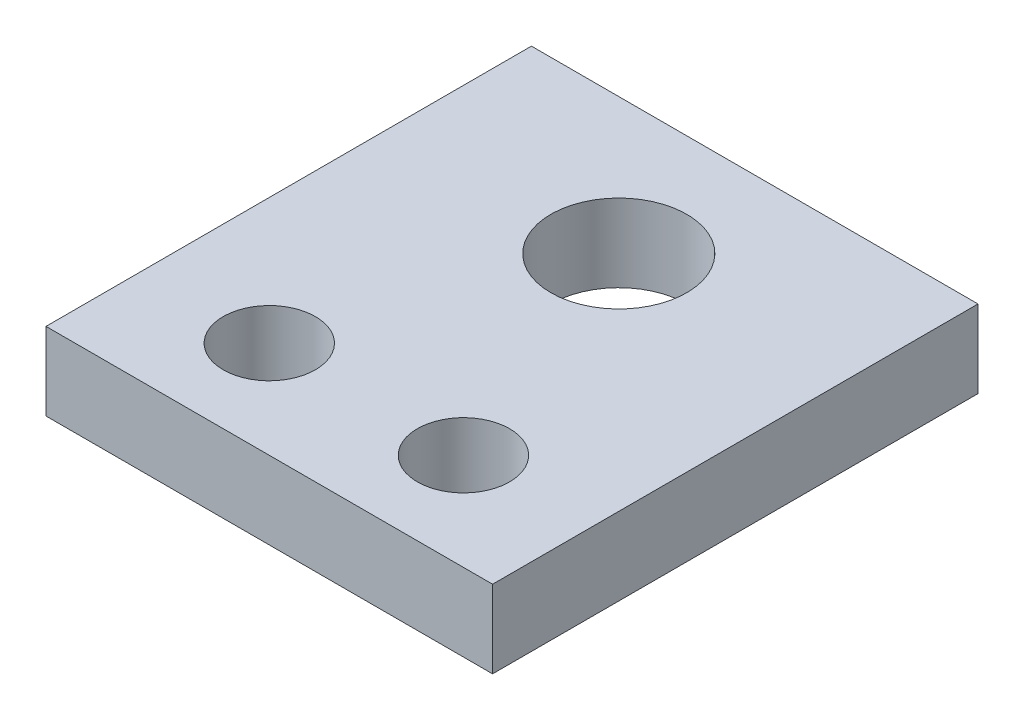
ISO-10303-21;
HEADER;
FILE_DESCRIPTION(('STEP AP214'),'2;1');
FILE_NAME('part.step','',(''),(''),'','','');
FILE_SCHEMA(('AUTOMOTIVE_DESIGN { 1 0 10303 214 1 1 1 1 }'));
ENDSEC;
DATA;
#1=APPLICATION_CONTEXT('core data for automotive mechanical design processes');
#2=APPLICATION_PROTOCOL_DEFINITION('international standard','automotive_design',2000,#1);
#3=PRODUCT_CONTEXT('',#1,'mechanical');
#4=PRODUCT('Part','Part','',(#3));
#5=PRODUCT_RELATED_PRODUCT_CATEGORY('part','',(#4));
#6=PRODUCT_DEFINITION_FORMATION('','',#4);
#7=PRODUCT_DEFINITION_CONTEXT('part definition',#1,'design');
#8=PRODUCT_DEFINITION('design','',#6,#7);
#9=PRODUCT_DEFINITION_SHAPE('','',#8);
#10=(LENGTH_UNIT() NAMED_UNIT(*) SI_UNIT(.MILLI.,.METRE.));
#11=(NAMED_UNIT(*) PLANE_ANGLE_UNIT() SI_UNIT($,.RADIAN.));
#12=(NAMED_UNIT(*) SI_UNIT($,.STERADIAN.) SOLID_ANGLE_UNIT());
#13=UNCERTAINTY_MEASURE_WITH_UNIT(LENGTH_MEASURE(1.E-05),#10,'distance_accuracy_value','');
#14=(GEOMETRIC_REPRESENTATION_CONTEXT(3) GLOBAL_UNCERTAINTY_ASSIGNED_CONTEXT((#13)) GLOBAL_UNIT_ASSIGNED_CONTEXT((#10,
#11,#12)) REPRESENTATION_CONTEXT('',''));
#15=CARTESIAN_POINT('',(0.,0.,0.));
#16=DIRECTION('',(0.,0.,1.));
#17=DIRECTION('',(1.,0.,0.));
#18=AXIS2_PLACEMENT_3D('',#15,#16,#17);
#19=CARTESIAN_POINT('',(23.,8.,-25.));
#20=DIRECTION('',(-1.,0.,0.));
#21=DIRECTION('',(0.,0.,1.));
#22=AXIS2_PLACEMENT_3D('',#19,#20,#21);
#23=PLANE('',#22);
#24=DIRECTION('',(0.,0.,-1.));
#25=VECTOR('',#24,1.);
#26=CARTESIAN_POINT('',(23.,0.,-25.));
#27=LINE('',#26,#25);
#28=CARTESIAN_POINT('',(23.,0.,25.));
#29=VERTEX_POINT('',#28);
#30=CARTESIAN_POINT('',(23.,0.,-25.));
#31=VERTEX_POINT('',#30);
#32=EDGE_CURVE('E100',#29,#31,#27,.T.);
#33=ORIENTED_EDGE('',*,*,#32,.T.);
#34=DIRECTION('',(0.,-1.,0.));
#35=VECTOR('',#34,1.);
#36=CARTESIAN_POINT('',(23.,8.,-25.));
#37=LINE('',#36,#35);
#38=CARTESIAN_POINT('',(23.,8.,-25.));
#39=VERTEX_POINT('',#38);
#40=EDGE_CURVE('E11',#39,#31,#37,.T.);
#41=ORIENTED_EDGE('',*,*,#40,.F.);
#42=DIRECTION('',(0.,0.,-1.));
#43=VECTOR('',#42,1.);
#44=CARTESIAN_POINT('',(23.,8.,-25.));
#45=LINE('',#44,#43);
#46=CARTESIAN_POINT('',(23.,8.,25.));
#47=VERTEX_POINT('',#46);
#48=EDGE_CURVE('E88',#47,#39,#45,.T.);
#49=ORIENTED_EDGE('',*,*,#48,.F.);
#50=DIRECTION('',(0.,-1.,0.));
#51=VECTOR('',#50,1.);
#52=CARTESIAN_POINT('',(23.,8.,25.));
#53=LINE('',#52,#51);
#54=EDGE_CURVE('E96',#47,#29,#53,.T.);
#55=ORIENTED_EDGE('',*,*,#54,.T.);
#56=EDGE_LOOP('',(#33,#41,#49,#55));
#57=FACE_BOUND('',#56,.T.);
#58=ADVANCED_FACE('F37',(#57),#23,.F.);
#59=CARTESIAN_POINT('',(-23.,8.,-25.));
#60=DIRECTION('',(0.,0.,1.));
#61=DIRECTION('',(1.,0.,0.));
#62=AXIS2_PLACEMENT_3D('',#59,#60,#61);
#63=PLANE('',#62);
#64=DIRECTION('',(-1.,0.,0.));
#65=VECTOR('',#64,1.);
#66=CARTESIAN_POINT('',(-23.,0.,-25.));
#67=LINE('',#66,#65);
#68=CARTESIAN_POINT('',(-23.,0.,-25.));
#69=VERTEX_POINT('',#68);
#70=EDGE_CURVE('E92',#31,#69,#67,.T.);
#71=ORIENTED_EDGE('',*,*,#70,.T.);
#72=DIRECTION('',(0.,-1.,0.));
#73=VECTOR('',#72,1.);
#74=CARTESIAN_POINT('',(-23.,8.,-25.));
#75=LINE('',#74,#73);
#76=CARTESIAN_POINT('',(-23.,8.,-25.));
#77=VERTEX_POINT('',#76);
#78=EDGE_CURVE('E45',#77,#69,#75,.T.);
#79=ORIENTED_EDGE('',*,*,#78,.F.);
#80=DIRECTION('',(-1.,0.,0.));
#81=VECTOR('',#80,1.);
#82=CARTESIAN_POINT('',(-23.,8.,-25.));
#83=LINE('',#82,#81);
#84=EDGE_CURVE('E83',#39,#77,#83,.T.);
#85=ORIENTED_EDGE('',*,*,#84,.F.);
#86=ORIENTED_EDGE('',*,*,#40,.T.);
#87=EDGE_LOOP('',(#71,#79,#85,#86));
#88=FACE_BOUND('',#87,.T.);
#89=ADVANCED_FACE('F91',(#88),#63,.F.);
#90=CARTESIAN_POINT('',(-23.,8.,-25.));
#91=DIRECTION('',(1.,0.,0.));
#92=DIRECTION('',(0.,0.,-1.));
#93=AXIS2_PLACEMENT_3D('',#90,#91,#92);
#94=PLANE('',#93);
#95=DIRECTION('',(0.,0.,1.));
#96=VECTOR('',#95,1.);
#97=CARTESIAN_POINT('',(-23.,0.,-25.));
#98=LINE('',#97,#96);
#99=CARTESIAN_POINT('',(-23.,0.,25.));
#100=VERTEX_POINT('',#99);
#101=EDGE_CURVE('E70',#69,#100,#98,.T.);
#102=ORIENTED_EDGE('',*,*,#101,.T.);
#103=DIRECTION('',(0.,-1.,0.));
#104=VECTOR('',#103,1.);
#105=CARTESIAN_POINT('',(-23.,8.,25.));
#106=LINE('',#105,#104);
#107=CARTESIAN_POINT('',(-23.,8.,25.));
#108=VERTEX_POINT('',#107);
#109=EDGE_CURVE('E93',#108,#100,#106,.T.);
#110=ORIENTED_EDGE('',*,*,#109,.F.);
#111=DIRECTION('',(0.,0.,1.));
#112=VECTOR('',#111,1.);
#113=CARTESIAN_POINT('',(-23.,8.,-25.));
#114=LINE('',#113,#112);
#115=EDGE_CURVE('E86',#77,#108,#114,.T.);
#116=ORIENTED_EDGE('',*,*,#115,.F.);
#117=ORIENTED_EDGE('',*,*,#78,.T.);
#118=EDGE_LOOP('',(#102,#110,#116,#117));
#119=FACE_BOUND('',#118,.T.);
#120=ADVANCED_FACE('F94',(#119),#94,.F.);
#121=CARTESIAN_POINT('',(-23.,8.,25.));
#122=DIRECTION('',(0.,0.,-1.));
#123=DIRECTION('',(-1.,0.,0.));
#124=AXIS2_PLACEMENT_3D('',#121,#122,#123);
#125=PLANE('',#124);
#126=DIRECTION('',(1.,0.,0.));
#127=VECTOR('',#126,1.);
#128=CARTESIAN_POINT('',(-23.,0.,25.));
#129=LINE('',#128,#127);
#130=EDGE_CURVE('E76',#100,#29,#129,.T.);
#131=ORIENTED_EDGE('',*,*,#130,.T.);
#132=ORIENTED_EDGE('',*,*,#54,.F.);
#133=DIRECTION('',(1.,0.,0.));
#134=VECTOR('',#133,1.);
#135=CARTESIAN_POINT('',(-23.,8.,25.));
#136=LINE('',#135,#134);
#137=EDGE_CURVE('E53',#108,#47,#136,.T.);
#138=ORIENTED_EDGE('',*,*,#137,.F.);
#139=ORIENTED_EDGE('',*,*,#109,.T.);
#140=EDGE_LOOP('',(#131,#132,#138,#139));
#141=FACE_BOUND('',#140,.T.);
#142=ADVANCED_FACE('F108',(#141),#125,.F.);
#143=CARTESIAN_POINT('',(0.,8.,0.));
#144=DIRECTION('',(0.,1.,0.));
#145=DIRECTION('',(0.,0.,1.));
#146=AXIS2_PLACEMENT_3D('',#143,#144,#145);
#147=PLANE('',#146);
#148=CARTESIAN_POINT('',(0.,8.,-11.));
#149=DIRECTION('',(0.,1.,0.));
#150=DIRECTION('',(0.,0.,1.));
#151=AXIS2_PLACEMENT_3D('',#148,#149,#150);
#152=CIRCLE('',#151,7.);
#153=CARTESIAN_POINT('',(0.,8.,-4.));
#154=VERTEX_POINT('',#153);
#155=EDGE_CURVE('E126',#154,#154,#152,.T.);
#156=ORIENTED_EDGE('',*,*,#155,.F.);
#157=EDGE_LOOP('',(#156));
#158=FACE_BOUND('',#157,.T.);
#159=CARTESIAN_POINT('',(-10.,8.,15.));
#160=DIRECTION('',(0.,1.,0.));
#161=DIRECTION('',(0.,0.,1.));
#162=AXIS2_PLACEMENT_3D('',#159,#160,#161);
#163=CIRCLE('',#162,4.75);
#164=CARTESIAN_POINT('',(-10.,8.,19.75));
#165=VERTEX_POINT('',#164);
#166=EDGE_CURVE('E120',#165,#165,#163,.T.);
#167=ORIENTED_EDGE('',*,*,#166,.F.);
#168=EDGE_LOOP('',(#167));
#169=FACE_BOUND('',#168,.T.);
#170=CARTESIAN_POINT('',(10.,8.,15.));
#171=DIRECTION('',(0.,1.,0.));
#172=DIRECTION('',(0.,0.,-1.));
#173=AXIS2_PLACEMENT_3D('',#170,#171,#172);
#174=CIRCLE('',#173,4.75);
#175=CARTESIAN_POINT('',(10.,8.,10.25));
#176=VERTEX_POINT('',#175);
#177=EDGE_CURVE('E114',#176,#176,#174,.T.);
#178=ORIENTED_EDGE('',*,*,#177,.F.);
#179=EDGE_LOOP('',(#178));
#180=FACE_BOUND('',#179,.T.);
#181=ORIENTED_EDGE('',*,*,#48,.T.);
#182=ORIENTED_EDGE('',*,*,#84,.T.);
#183=ORIENTED_EDGE('',*,*,#115,.T.);
#184=ORIENTED_EDGE('',*,*,#137,.T.);
#185=EDGE_LOOP('',(#181,#182,#183,#184));
#186=FACE_BOUND('',#185,.T.);
#187=ADVANCED_FACE('F84',(#158,#169,#180,#186),#147,.T.);
#188=CARTESIAN_POINT('',(0.,0.,0.));
#189=DIRECTION('',(0.,1.,0.));
#190=DIRECTION('',(0.,0.,1.));
#191=AXIS2_PLACEMENT_3D('',#188,#189,#190);
#192=PLANE('',#191);
#193=CARTESIAN_POINT('',(0.,0.,-11.));
#194=DIRECTION('',(0.,1.,0.));
#195=DIRECTION('',(0.,0.,1.));
#196=AXIS2_PLACEMENT_3D('',#193,#194,#195);
#197=CIRCLE('',#196,7.);
#198=CARTESIAN_POINT('',(0.,0.,-4.));
#199=VERTEX_POINT('',#198);
#200=EDGE_CURVE('E103',#199,#199,#197,.T.);
#201=ORIENTED_EDGE('',*,*,#200,.T.);
#202=EDGE_LOOP('',(#201));
#203=FACE_BOUND('',#202,.T.);
#204=CARTESIAN_POINT('',(-10.,0.,15.));
#205=DIRECTION('',(0.,1.,0.));
#206=DIRECTION('',(0.,0.,1.));
#207=AXIS2_PLACEMENT_3D('',#204,#205,#206);
#208=CIRCLE('',#207,4.75);
#209=CARTESIAN_POINT('',(-10.,0.,19.75));
#210=VERTEX_POINT('',#209);
#211=EDGE_CURVE('E123',#210,#210,#208,.T.);
#212=ORIENTED_EDGE('',*,*,#211,.T.);
#213=EDGE_LOOP('',(#212));
#214=FACE_BOUND('',#213,.T.);
#215=CARTESIAN_POINT('',(10.,0.,15.));
#216=DIRECTION('',(0.,1.,0.));
#217=DIRECTION('',(0.,0.,-1.));
#218=AXIS2_PLACEMENT_3D('',#215,#216,#217);
#219=CIRCLE('',#218,4.75);
#220=CARTESIAN_POINT('',(10.,0.,10.25));
#221=VERTEX_POINT('',#220);
#222=EDGE_CURVE('E117',#221,#221,#219,.T.);
#223=ORIENTED_EDGE('',*,*,#222,.T.);
#224=EDGE_LOOP('',(#223));
#225=FACE_BOUND('',#224,.T.);
#226=ORIENTED_EDGE('',*,*,#32,.F.);
#227=ORIENTED_EDGE('',*,*,#130,.F.);
#228=ORIENTED_EDGE('',*,*,#101,.F.);
#229=ORIENTED_EDGE('',*,*,#70,.F.);
#230=EDGE_LOOP('',(#226,#227,#228,#229));
#231=FACE_BOUND('',#230,.T.);
#232=ADVANCED_FACE('F111',(#203,#214,#225,#231),#192,.F.);
#233=CARTESIAN_POINT('',(10.,0.,15.));
#234=DIRECTION('',(0.,1.,0.));
#235=DIRECTION('',(0.,0.,1.));
#236=AXIS2_PLACEMENT_3D('',#233,#234,#235);
#237=CYLINDRICAL_SURFACE('',#236,4.75);
#238=ORIENTED_EDGE('',*,*,#222,.F.);
#239=EDGE_LOOP('',(#238));
#240=FACE_BOUND('',#239,.T.);
#241=ORIENTED_EDGE('',*,*,#177,.T.);
#242=EDGE_LOOP('',(#241));
#243=FACE_BOUND('',#242,.T.);
#244=ADVANCED_FACE('F148',(#240,#243),#237,.F.);
#245=CARTESIAN_POINT('',(-10.,0.,15.));
#246=DIRECTION('',(0.,1.,0.));
#247=DIRECTION('',(0.,0.,1.));
#248=AXIS2_PLACEMENT_3D('',#245,#246,#247);
#249=CYLINDRICAL_SURFACE('',#248,4.75);
#250=ORIENTED_EDGE('',*,*,#211,.F.);
#251=EDGE_LOOP('',(#250));
#252=FACE_BOUND('',#251,.T.);
#253=ORIENTED_EDGE('',*,*,#166,.T.);
#254=EDGE_LOOP('',(#253));
#255=FACE_BOUND('',#254,.T.);
#256=ADVANCED_FACE('F137',(#252,#255),#249,.F.);
#257=CARTESIAN_POINT('',(0.,0.,-11.));
#258=DIRECTION('',(0.,1.,0.));
#259=DIRECTION('',(0.,0.,1.));
#260=AXIS2_PLACEMENT_3D('',#257,#258,#259);
#261=CYLINDRICAL_SURFACE('',#260,7.);
#262=ORIENTED_EDGE('',*,*,#200,.F.);
#263=EDGE_LOOP('',(#262));
#264=FACE_BOUND('',#263,.T.);
#265=ORIENTED_EDGE('',*,*,#155,.T.);
#266=EDGE_LOOP('',(#265));
#267=FACE_BOUND('',#266,.T.);
#268=ADVANCED_FACE('F134',(#264,#267),#261,.F.);
#269=CLOSED_SHELL('',(#58,#89,#120,#142,#187,#232,#244,#256,#268));
#270=MANIFOLD_SOLID_BREP('B2',#269);
#271=ADVANCED_BREP_SHAPE_REPRESENTATION('',(#18,#270),#14);
#272=SHAPE_DEFINITION_REPRESENTATION(#9,#271);
ENDSEC;
END-ISO-10303-21;
